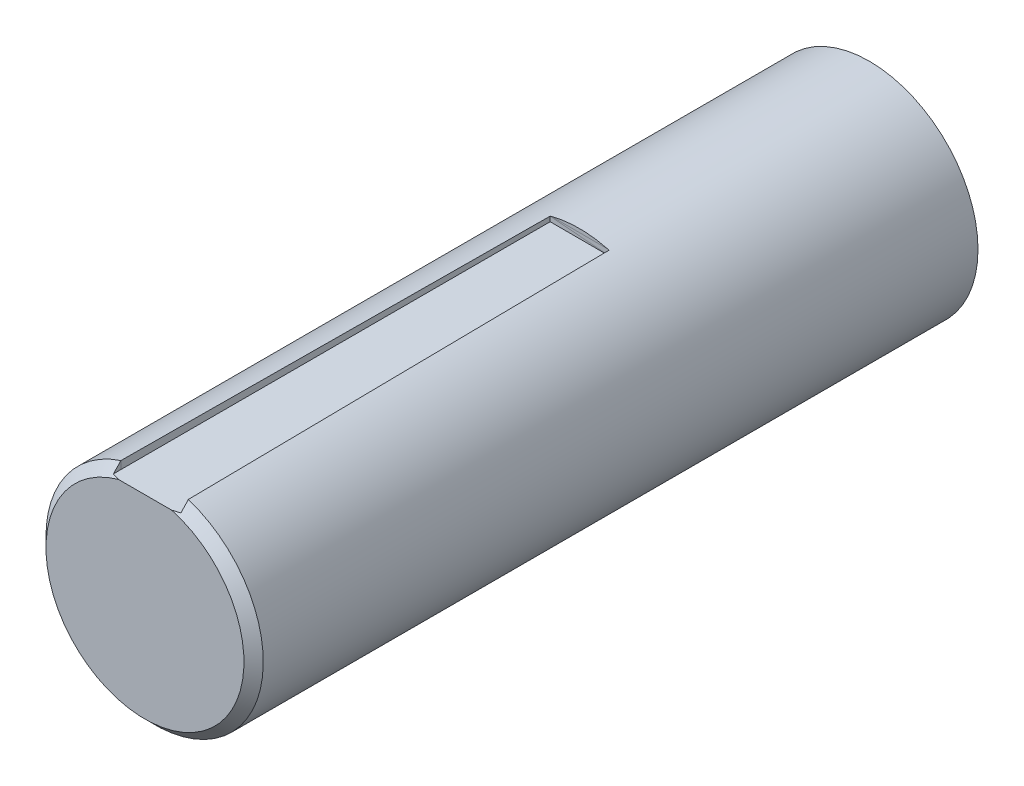
ISO-10303-21;
HEADER;
FILE_DESCRIPTION(('STEP AP214'),'2;1');
FILE_NAME('part.step','',(''),(''),'','','');
FILE_SCHEMA(('AUTOMOTIVE_DESIGN { 1 0 10303 214 1 1 1 1 }'));
ENDSEC;
DATA;
#1=APPLICATION_CONTEXT('core data for automotive mechanical design processes');
#2=APPLICATION_PROTOCOL_DEFINITION('international standard','automotive_design',2000,#1);
#3=PRODUCT_CONTEXT('',#1,'mechanical');
#4=PRODUCT('Part','Part','',(#3));
#5=PRODUCT_RELATED_PRODUCT_CATEGORY('part','',(#4));
#6=PRODUCT_DEFINITION_FORMATION('','',#4);
#7=PRODUCT_DEFINITION_CONTEXT('part definition',#1,'design');
#8=PRODUCT_DEFINITION('design','',#6,#7);
#9=PRODUCT_DEFINITION_SHAPE('','',#8);
#10=(LENGTH_UNIT() NAMED_UNIT(*) SI_UNIT(.MILLI.,.METRE.));
#11=(NAMED_UNIT(*) PLANE_ANGLE_UNIT() SI_UNIT($,.RADIAN.));
#12=(NAMED_UNIT(*) SI_UNIT($,.STERADIAN.) SOLID_ANGLE_UNIT());
#13=UNCERTAINTY_MEASURE_WITH_UNIT(LENGTH_MEASURE(1.E-05),#10,'distance_accuracy_value','');
#14=(GEOMETRIC_REPRESENTATION_CONTEXT(3) GLOBAL_UNCERTAINTY_ASSIGNED_CONTEXT((#13)) GLOBAL_UNIT_ASSIGNED_CONTEXT((#10,
#11,#12)) REPRESENTATION_CONTEXT('',''));
#15=CARTESIAN_POINT('',(0.,0.,0.));
#16=DIRECTION('',(0.,0.,1.));
#17=DIRECTION('',(1.,0.,0.));
#18=AXIS2_PLACEMENT_3D('',#15,#16,#17);
#19=CARTESIAN_POINT('',(0.,0.,150.));
#20=DIRECTION('',(0.,0.,-1.));
#21=DIRECTION('',(-1.,0.,0.));
#22=AXIS2_PLACEMENT_3D('',#19,#20,#21);
#23=CYLINDRICAL_SURFACE('',#22,22.5);
#24=CARTESIAN_POINT('',(0.,0.,0.));
#25=DIRECTION('',(0.,0.,1.));
#26=DIRECTION('',(1.,0.,0.));
#27=AXIS2_PLACEMENT_3D('',#24,#25,#26);
#28=CIRCLE('',#27,22.5);
#29=CARTESIAN_POINT('',(22.5,0.,0.));
#30=VERTEX_POINT('',#29);
#31=EDGE_CURVE('E212',#30,#30,#28,.T.);
#32=ORIENTED_EDGE('',*,*,#31,.T.);
#33=EDGE_LOOP('',(#32));
#34=FACE_BOUND('',#33,.T.);
#35=CARTESIAN_POINT('',(0.,0.,59.7895778569438));
#36=DIRECTION('',(-0.000823485655129395,-0.00994820926528993,0.999950176260692));
#37=DIRECTION('',(-0.0824910158989033,-0.996541814125106,-0.00998223402902398));
#38=AXIS2_PLACEMENT_3D('',#35,#36,#37);
#39=ELLIPSE('',#38,22.5011210899913,22.5);
#40=CARTESIAN_POINT('',(5.78817413864547,21.7427468398249,60.0106567458581));
#41=VERTEX_POINT('',#40);
#42=CARTESIAN_POINT('',(-5.78853045082907,21.7426519822175,60.0011220769788));
#43=VERTEX_POINT('',#42);
#44=EDGE_CURVE('E58',#41,#43,#39,.T.);
#45=ORIENTED_EDGE('',*,*,#44,.F.);
#46=CARTESIAN_POINT('',(0.,0.,-2125.47448485976));
#47=DIRECTION('',(0.,0.999950515308283,-0.00994821263837438));
#48=DIRECTION('',(0.,-0.00994821263837438,-0.999950515308284));
#49=AXIS2_PLACEMENT_3D('',#46,#47,#48);
#50=ELLIPSE('',#49,2261.71281393888,22.5);
#51=CARTESIAN_POINT('',(5.7885723814903,21.7426408190047,60.));
#52=VERTEX_POINT('',#51);
#53=EDGE_CURVE('E52',#52,#41,#50,.F.);
#54=ORIENTED_EDGE('',*,*,#53,.F.);
#55=CARTESIAN_POINT('',(0.,0.,60.));
#56=DIRECTION('',(0.,0.,1.));
#57=DIRECTION('',(1.,0.,0.));
#58=AXIS2_PLACEMENT_3D('',#55,#56,#57);
#59=CIRCLE('',#58,22.5);
#60=CARTESIAN_POINT('',(6.10461655477255,21.6560304931259,60.));
#61=VERTEX_POINT('',#60);
#62=EDGE_CURVE('E11',#61,#52,#59,.T.);
#63=ORIENTED_EDGE('',*,*,#62,.F.);
#64=CARTESIAN_POINT('',(0.,0.,-553.609166953008));
#65=DIRECTION('',(0.999950515308283,0.,-0.00994821263837438));
#66=DIRECTION('',(-0.00994821263837438,0.,-0.999950515308284));
#67=AXIS2_PLACEMENT_3D('',#64,#65,#66);
#68=ELLIPSE('',#67,2261.71281393888,22.5);
#69=CARTESIAN_POINT('',(6.98010259010606,21.3899080837535,148.));
#70=VERTEX_POINT('',#69);
#71=EDGE_CURVE('E290',#70,#61,#68,.F.);
#72=ORIENTED_EDGE('',*,*,#71,.F.);
#73=CARTESIAN_POINT('',(0.,0.,148.));
#74=DIRECTION('',(0.,0.,1.));
#75=DIRECTION('',(1.,0.,0.));
#76=AXIS2_PLACEMENT_3D('',#73,#74,#75);
#77=CIRCLE('',#76,22.5);
#78=CARTESIAN_POINT('',(-6.98010259010981,21.3899081595712,148.000000000754));
#79=VERTEX_POINT('',#78);
#80=EDGE_CURVE('E202',#70,#79,#77,.F.);
#81=ORIENTED_EDGE('',*,*,#80,.T.);
#82=CARTESIAN_POINT('',(-6.10461655477255,21.6560304931061,59.9999999999998));
#83=DIRECTION('',(-0.00994816715353646,-0.00302395481440146,0.999945943372723));
#84=VECTOR('',#83,1.);
#85=LINE('',#82,#84);
#86=CARTESIAN_POINT('',(-6.10461655477255,21.656030493106,59.9999999999998));
#87=VERTEX_POINT('',#86);
#88=EDGE_CURVE('E157',#87,#79,#85,.T.);
#89=ORIENTED_EDGE('',*,*,#88,.F.);
#90=CARTESIAN_POINT('',(-5.7885723814903,21.7426408190047,60.));
#91=VERTEX_POINT('',#90);
#92=EDGE_CURVE('E46',#91,#87,#59,.T.);
#93=ORIENTED_EDGE('',*,*,#92,.F.);
#94=EDGE_CURVE('E267',#43,#91,#50,.F.);
#95=ORIENTED_EDGE('',*,*,#94,.F.);
#96=EDGE_LOOP('',(#45,#54,#63,#72,#81,#89,#93,#95));
#97=FACE_BOUND('',#96,.T.);
#98=ADVANCED_FACE('F40',(#34,#97),#23,.T.);
#99=CARTESIAN_POINT('',(0.,22.6380242642321,150.));
#100=DIRECTION('',(0.,0.999950515308283,-0.00994821263837438));
#101=DIRECTION('',(0.,0.00994821263837438,0.999950515308283));
#102=AXIS2_PLACEMENT_3D('',#99,#100,#101);
#103=PLANE('',#102);
#104=ORIENTED_EDGE('',*,*,#53,.T.);
#105=DIRECTION('',(0.999999660801366,8.19383223769833E-06,0.000823607924988518));
#106=VECTOR('',#105,1.);
#107=CARTESIAN_POINT('',(0.0741271735599891,21.7427000198668,60.0059506098976));
#108=LINE('',#107,#106);
#109=EDGE_CURVE('E275',#41,#43,#108,.F.);
#110=ORIENTED_EDGE('',*,*,#109,.T.);
#111=ORIENTED_EDGE('',*,*,#94,.T.);
#112=DIRECTION('',(-1.,0.,0.));
#113=VECTOR('',#112,1.);
#114=CARTESIAN_POINT('',(0.,21.7426408190047,60.));
#115=LINE('',#114,#113);
#116=EDGE_CURVE('E273',#91,#52,#115,.F.);
#117=ORIENTED_EDGE('',*,*,#116,.T.);
#118=EDGE_LOOP('',(#104,#110,#111,#117));
#119=FACE_BOUND('',#118,.T.);
#120=ADVANCED_FACE('F183',(#119),#103,.F.);
#121=CARTESIAN_POINT('',(0.,0.,60.));
#122=DIRECTION('',(0.,0.,1.));
#123=DIRECTION('',(1.,0.,0.));
#124=AXIS2_PLACEMENT_3D('',#121,#122,#123);
#125=PLANE('',#124);
#126=ORIENTED_EDGE('',*,*,#92,.T.);
#127=DIRECTION('',(0.996591468038605,-0.082495126114561,0.));
#128=VECTOR('',#127,1.);
#129=CARTESIAN_POINT('',(1.73888292919794,21.0067669785738,60.));
#130=LINE('',#129,#128);
#131=CARTESIAN_POINT('',(6.10461655477255,20.6453834452275,60.));
#132=VERTEX_POINT('',#131);
#133=EDGE_CURVE('E121',#87,#132,#130,.T.);
#134=ORIENTED_EDGE('',*,*,#133,.T.);
#135=DIRECTION('',(0.,1.,0.));
#136=VECTOR('',#135,1.);
#137=CARTESIAN_POINT('',(6.10461655477255,0.,60.));
#138=LINE('',#137,#136);
#139=EDGE_CURVE('E277',#61,#132,#138,.F.);
#140=ORIENTED_EDGE('',*,*,#139,.F.);
#141=ORIENTED_EDGE('',*,*,#62,.T.);
#142=ORIENTED_EDGE('',*,*,#116,.F.);
#143=EDGE_LOOP('',(#126,#134,#140,#141,#142));
#144=FACE_BOUND('',#143,.T.);
#145=ADVANCED_FACE('F179',(#144),#125,.T.);
#146=CARTESIAN_POINT('',(-7.00000000000001,0.,150.));
#147=DIRECTION('',(-0.999950515308283,0.,-0.00994821263837438));
#148=DIRECTION('',(-0.00994821263837438,0.,0.999950515308283));
#149=AXIS2_PLACEMENT_3D('',#146,#147,#148);
#150=PLANE('',#149);
#151=DIRECTION('',(9.89718318038703E-05,-0.999950510410814,-0.0099482125896509));
#152=VECTOR('',#151,1.);
#153=CARTESIAN_POINT('',(-6.97798766587082,0.0220145128380417,147.787417131525));
#154=LINE('',#153,#152);
#155=CARTESIAN_POINT('',(-6.97994226261549,19.7700577373845,147.983884586846));
#156=VERTEX_POINT('',#155);
#157=EDGE_CURVE('E153',#79,#156,#154,.T.);
#158=ORIENTED_EDGE('',*,*,#157,.F.);
#159=CARTESIAN_POINT('',(-6.98010060036507,21.3901191125431,147.9998));
#160=CARTESIAN_POINT('',(-6.98267340804539,21.117294411706,148.258407295526));
#161=CARTESIAN_POINT('',(-6.98524325486982,20.8441888076931,148.516716978859));
#162=CARTESIAN_POINT('',(-6.99037702702372,20.2974157702261,149.032741142935));
#163=CARTESIAN_POINT('',(-6.99294095235268,20.0237483367247,149.290455623626));
#164=CARTESIAN_POINT('',(-6.99550191682526,19.7498,149.547872492076));
#165=B_SPLINE_CURVE_WITH_KNOTS('',3,(#159,#160,#161,#162,#163,#164),.UNSPECIFIED.,.F.,.F.,(4,2,
4),(0.,1.12776527169477,2.25553063863649),.UNSPECIFIED.);
#166=CARTESIAN_POINT('',(-6.99545759004928,19.7545424099507,149.543416959802));
#167=VERTEX_POINT('',#166);
#168=EDGE_CURVE('E200',#79,#167,#165,.T.);
#169=ORIENTED_EDGE('',*,*,#168,.T.);
#170=DIRECTION('',(-0.00994772040285509,-0.00994772040285509,0.999901037962044));
#171=VECTOR('',#170,1.);
#172=CARTESIAN_POINT('',(-7.00195440353896,19.748045596461,150.196448035134));
#173=LINE('',#172,#171);
#174=EDGE_CURVE('E66',#156,#167,#173,.T.);
#175=ORIENTED_EDGE('',*,*,#174,.F.);
#176=EDGE_LOOP('',(#158,#169,#175));
#177=FACE_BOUND('',#176,.T.);
#178=ADVANCED_FACE('F182',(#177),#150,.F.);
#179=CARTESIAN_POINT('',(7.,0.,150.));
#180=DIRECTION('',(0.999950515308283,0.,-0.00994821263837438));
#181=DIRECTION('',(-0.00994821263837438,0.,-0.999950515308283));
#182=AXIS2_PLACEMENT_3D('',#179,#180,#181);
#183=PLANE('',#182);
#184=CARTESIAN_POINT('',(6.98010060036507,21.3901191125431,147.9998));
#185=CARTESIAN_POINT('',(6.98267340804539,21.117294411706,148.258407295526));
#186=CARTESIAN_POINT('',(6.98524325486982,20.8441888076931,148.516716978859));
#187=CARTESIAN_POINT('',(6.99037702702372,20.2974157702261,149.032741142935));
#188=CARTESIAN_POINT('',(6.99294095235268,20.0237483367247,149.290455623626));
#189=CARTESIAN_POINT('',(6.99550191682525,19.7498,149.547872492076));
#190=B_SPLINE_CURVE_WITH_KNOTS('',3,(#184,#185,#186,#187,#188,#189),.UNSPECIFIED.,.F.,.F.,(4,2,
4),(0.,1.12776527169477,2.25553063863649),.UNSPECIFIED.);
#191=CARTESIAN_POINT('',(6.99545759004928,19.7545424099507,149.543416959802));
#192=VERTEX_POINT('',#191);
#193=EDGE_CURVE('E232',#70,#192,#190,.T.);
#194=ORIENTED_EDGE('',*,*,#193,.F.);
#195=DIRECTION('',(9.89718318041857E-05,0.999950510410814,0.0099482125896509));
#196=VECTOR('',#195,1.);
#197=CARTESIAN_POINT('',(6.97798766587082,0.0220145128380395,147.787417131525));
#198=LINE('',#197,#196);
#199=CARTESIAN_POINT('',(6.97994226261549,19.7700577373845,147.983884586846));
#200=VERTEX_POINT('',#199);
#201=EDGE_CURVE('E284',#70,#200,#198,.F.);
#202=ORIENTED_EDGE('',*,*,#201,.T.);
#203=DIRECTION('',(-0.00994772040285509,0.00994772040285509,-0.999901037962044));
#204=VECTOR('',#203,1.);
#205=CARTESIAN_POINT('',(7.00195440353896,19.748045596461,150.196448035134));
#206=LINE('',#205,#204);
#207=EDGE_CURVE('E294',#200,#192,#206,.F.);
#208=ORIENTED_EDGE('',*,*,#207,.T.);
#209=EDGE_LOOP('',(#194,#202,#208));
#210=FACE_BOUND('',#209,.T.);
#211=ADVANCED_FACE('F188',(#210),#183,.F.);
#212=ORIENTED_EDGE('',*,*,#139,.T.);
#213=DIRECTION('',(-0.00994785664528011,-0.00845978584925541,-0.999914732450497));
#214=VECTOR('',#213,1.);
#215=CARTESIAN_POINT('',(6.99819847111618,21.4052970548212,149.818918251831));
#216=LINE('',#215,#214);
#217=EDGE_CURVE('E124',#132,#70,#216,.F.);
#218=ORIENTED_EDGE('',*,*,#217,.T.);
#219=ORIENTED_EDGE('',*,*,#71,.T.);
#220=EDGE_LOOP('',(#212,#218,#219));
#221=FACE_BOUND('',#220,.T.);
#222=ADVANCED_FACE('F243',(#221),#183,.F.);
#223=CARTESIAN_POINT('',(0.,0.,150.));
#224=DIRECTION('',(0.,0.,-1.));
#225=DIRECTION('',(-1.,0.,0.));
#226=AXIS2_PLACEMENT_3D('',#223,#224,#225);
#227=CONICAL_SURFACE('',#226,20.5,0.785398163397458);
#228=ORIENTED_EDGE('',*,*,#80,.F.);
#229=ORIENTED_EDGE('',*,*,#193,.T.);
#230=CARTESIAN_POINT('',(5.49357612441709,19.749998010259,150.0002));
#231=CARTESIAN_POINT('',(5.62029077119369,19.7503391081035,149.965914347116));
#232=CARTESIAN_POINT('',(5.74672713135603,19.7506903987369,149.930604159978));
#233=CARTESIAN_POINT('',(5.99900049316049,19.7514126089629,149.858010769195));
#234=CARTESIAN_POINT('',(6.12483762716229,19.7517835239785,149.820728025608));
#235=CARTESIAN_POINT('',(6.37592752083061,19.7525443820797,149.744249920643));
#236=CARTESIAN_POINT('',(6.50118028557036,19.7529343249998,149.705054575902));
#237=CARTESIAN_POINT('',(6.7511224296301,19.7537326638675,149.624809069381));
#238=CARTESIAN_POINT('',(6.87581167133882,19.75414106408,149.583758478907));
#239=CARTESIAN_POINT('',(7.00020000000001,19.7545583131252,149.54181844275));
#240=B_SPLINE_CURVE_WITH_KNOTS('',3,(#230,#231,#232,#233,#234,#235,#236,#237,#238,#239),
.UNSPECIFIED.,.F.,.F.,(4,2,2,2,4),(0.,0.393808954590328,0.787526462605249,1.18124054615596,
1.57504607542073),.UNSPECIFIED.);
#241=CARTESIAN_POINT('',(5.49431524395903,19.75,150.));
#242=VERTEX_POINT('',#241);
#243=EDGE_CURVE('E225',#242,#192,#240,.T.);
#244=ORIENTED_EDGE('',*,*,#243,.F.);
#245=CARTESIAN_POINT('',(0.,0.,150.));
#246=DIRECTION('',(0.,0.,1.));
#247=DIRECTION('',(1.,0.,0.));
#248=AXIS2_PLACEMENT_3D('',#245,#246,#247);
#249=CIRCLE('',#248,20.5);
#250=CARTESIAN_POINT('',(-5.49431524395903,19.75,150.));
#251=VERTEX_POINT('',#250);
#252=EDGE_CURVE('E205',#251,#242,#249,.T.);
#253=ORIENTED_EDGE('',*,*,#252,.F.);
#254=CARTESIAN_POINT('',(-7.0002,19.7545583131252,149.54181844275));
#255=CARTESIAN_POINT('',(-6.87581167133881,19.75414106408,149.583758478907));
#256=CARTESIAN_POINT('',(-6.75112242963009,19.7537326638675,149.624809069381));
#257=CARTESIAN_POINT('',(-6.50118028557035,19.7529343249998,149.705054575902));
#258=CARTESIAN_POINT('',(-6.3759275208306,19.7525443820797,149.744249920643));
#259=CARTESIAN_POINT('',(-6.12483762716229,19.7517835239785,149.820728025608));
#260=CARTESIAN_POINT('',(-5.99900049316049,19.7514126089629,149.858010769195));
#261=CARTESIAN_POINT('',(-5.74672713135603,19.7506903987369,149.930604159978));
#262=CARTESIAN_POINT('',(-5.62029077119369,19.7503391081035,149.965914347116));
#263=CARTESIAN_POINT('',(-5.49357612441709,19.749998010259,150.0002));
#264=B_SPLINE_CURVE_WITH_KNOTS('',3,(#254,#255,#256,#257,#258,#259,#260,#261,#262,#263),
.UNSPECIFIED.,.F.,.F.,(4,2,2,2,4),(0.,0.393805529264767,0.787519612815481,1.18123712083038,
1.57504607542072),.UNSPECIFIED.);
#265=EDGE_CURVE('E204',#167,#251,#264,.T.);
#266=ORIENTED_EDGE('',*,*,#265,.F.);
#267=ORIENTED_EDGE('',*,*,#168,.F.);
#268=EDGE_LOOP('',(#228,#229,#244,#253,#266,#267));
#269=FACE_BOUND('',#268,.T.);
#270=ADVANCED_FACE('F43',(#269),#227,.T.);
#271=CARTESIAN_POINT('',(0.,0.,150.));
#272=DIRECTION('',(0.,0.,1.));
#273=DIRECTION('',(1.,0.,0.));
#274=AXIS2_PLACEMENT_3D('',#271,#272,#273);
#275=PLANE('',#274);
#276=DIRECTION('',(1.,0.,0.));
#277=VECTOR('',#276,1.);
#278=CARTESIAN_POINT('',(0.,19.75,150.));
#279=LINE('',#278,#277);
#280=EDGE_CURVE('E162',#251,#242,#279,.T.);
#281=ORIENTED_EDGE('',*,*,#280,.F.);
#282=ORIENTED_EDGE('',*,*,#252,.T.);
#283=EDGE_LOOP('',(#281,#282));
#284=FACE_BOUND('',#283,.T.);
#285=ADVANCED_FACE('F248',(#284),#275,.T.);
#286=CARTESIAN_POINT('',(0.,0.,0.));
#287=DIRECTION('',(0.,0.,1.));
#288=DIRECTION('',(1.,0.,0.));
#289=AXIS2_PLACEMENT_3D('',#286,#287,#288);
#290=PLANE('',#289);
#291=ORIENTED_EDGE('',*,*,#31,.F.);
#292=EDGE_LOOP('',(#291));
#293=FACE_BOUND('',#292,.T.);
#294=ADVANCED_FACE('F251',(#293),#290,.F.);
#295=CARTESIAN_POINT('',(0.,19.75,150.));
#296=DIRECTION('',(0.,-0.999950515308283,-0.00994821263837438));
#297=DIRECTION('',(0.,0.00994821263837438,-0.999950515308283));
#298=AXIS2_PLACEMENT_3D('',#295,#296,#297);
#299=PLANE('',#298);
#300=DIRECTION('',(-0.00994954227917538,0.00994772022253307,-0.999901019836868));
#301=VECTOR('',#300,1.);
#302=CARTESIAN_POINT('',(6.98010259010606,19.7700577373845,147.983884586846));
#303=LINE('',#302,#301);
#304=CARTESIAN_POINT('',(6.98010259010606,19.7700577373845,147.983884586846));
#305=VERTEX_POINT('',#304);
#306=EDGE_CURVE('E136',#305,#132,#303,.T.);
#307=ORIENTED_EDGE('',*,*,#306,.T.);
#308=DIRECTION('',(-0.999999660935631,8.19221040181045E-06,-0.000823444905195619));
#309=VECTOR('',#308,1.);
#310=CARTESIAN_POINT('',(6.10461655477255,20.6453834452275,60.));
#311=LINE('',#310,#309);
#312=CARTESIAN_POINT('',(-6.10461655477255,20.6454834658679,59.9899463657908));
#313=VERTEX_POINT('',#312);
#314=EDGE_CURVE('E118',#132,#313,#311,.T.);
#315=ORIENTED_EDGE('',*,*,#314,.T.);
#316=DIRECTION('',(-0.00994840561953582,-0.00994772033503896,0.999901031145466));
#317=VECTOR('',#316,1.);
#318=CARTESIAN_POINT('',(-6.10461655477255,20.6454834658679,59.9899463657908));
#319=LINE('',#318,#317);
#320=CARTESIAN_POINT('',(-6.98010259010606,19.7700577373845,147.983884586846));
#321=VERTEX_POINT('',#320);
#322=EDGE_CURVE('E128',#313,#321,#319,.T.);
#323=ORIENTED_EDGE('',*,*,#322,.T.);
#324=DIRECTION('',(1.,0.,0.));
#325=VECTOR('',#324,1.);
#326=CARTESIAN_POINT('',(-6.98010259010606,19.7700577373845,147.983884586846));
#327=LINE('',#326,#325);
#328=EDGE_CURVE('E140',#321,#156,#327,.T.);
#329=ORIENTED_EDGE('',*,*,#328,.T.);
#330=ORIENTED_EDGE('',*,*,#174,.T.);
#331=ORIENTED_EDGE('',*,*,#265,.T.);
#332=ORIENTED_EDGE('',*,*,#280,.T.);
#333=ORIENTED_EDGE('',*,*,#243,.T.);
#334=ORIENTED_EDGE('',*,*,#207,.F.);
#335=EDGE_CURVE('E132',#200,#305,#327,.T.);
#336=ORIENTED_EDGE('',*,*,#335,.T.);
#337=EDGE_LOOP('',(#307,#315,#323,#329,#330,#331,#332,#333,#334,#336));
#338=FACE_BOUND('',#337,.T.);
#339=ADVANCED_FACE('F134',(#338),#299,.F.);
#340=CARTESIAN_POINT('',(6.98010259010606,40.7690185588585,148.192797052252));
#341=DIRECTION('',(-0.999950502079195,-9.89801622477328E-05,0.00994904992914298));
#342=DIRECTION('',(0.00994904997787876,0.,0.999950506977489));
#343=AXIS2_PLACEMENT_3D('',#340,#341,#342);
#344=PLANE('',#343);
#345=ORIENTED_EDGE('',*,*,#306,.F.);
#346=DIRECTION('',(0.,-0.999950515308284,-0.00994821263837438));
#347=VECTOR('',#346,1.);
#348=CARTESIAN_POINT('',(6.98010259010606,40.7690185588585,148.192797052252));
#349=LINE('',#348,#347);
#350=EDGE_CURVE('E143',#70,#305,#349,.T.);
#351=ORIENTED_EDGE('',*,*,#350,.F.);
#352=ORIENTED_EDGE('',*,*,#217,.F.);
#353=EDGE_LOOP('',(#345,#351,#352));
#354=FACE_BOUND('',#353,.T.);
#355=ADVANCED_FACE('F305',(#354),#344,.T.);
#356=CARTESIAN_POINT('',(-6.98010259010606,40.7690185588585,148.192797052252));
#357=DIRECTION('',(0.,0.00994821263837438,-0.999950515308284));
#358=DIRECTION('',(0.,0.999950515308284,0.00994821263837438));
#359=AXIS2_PLACEMENT_3D('',#356,#357,#358);
#360=PLANE('',#359);
#361=ORIENTED_EDGE('',*,*,#350,.T.);
#362=ORIENTED_EDGE('',*,*,#335,.F.);
#363=ORIENTED_EDGE('',*,*,#201,.F.);
#364=EDGE_LOOP('',(#361,#362,#363));
#365=FACE_BOUND('',#364,.T.);
#366=ADVANCED_FACE('F174',(#365),#360,.T.);
#367=ORIENTED_EDGE('',*,*,#157,.T.);
#368=ORIENTED_EDGE('',*,*,#328,.F.);
#369=DIRECTION('',(0.,-0.999950515308284,-0.00994821263837438));
#370=VECTOR('',#369,1.);
#371=CARTESIAN_POINT('',(-6.98010259010606,40.7690185588585,148.192797052252));
#372=LINE('',#371,#370);
#373=EDGE_CURVE('E125',#79,#321,#372,.T.);
#374=ORIENTED_EDGE('',*,*,#373,.F.);
#375=EDGE_LOOP('',(#367,#368,#374));
#376=FACE_BOUND('',#375,.T.);
#377=ADVANCED_FACE('F178',(#376),#360,.T.);
#378=CARTESIAN_POINT('',(6.10461655477255,41.6443442667014,60.2089124654059));
#379=DIRECTION('',(-0.000823485655129395,-0.00994820926528993,0.999950176260692));
#380=DIRECTION('',(0.,-0.999950515308283,-0.00994821263837438));
#381=AXIS2_PLACEMENT_3D('',#378,#379,#380);
#382=PLANE('',#381);
#383=DIRECTION('',(0.,-0.999950515308284,-0.00994821263837438));
#384=VECTOR('',#383,1.);
#385=CARTESIAN_POINT('',(-6.10461655477255,41.6444442873418,60.1988588311966));
#386=LINE('',#385,#384);
#387=EDGE_CURVE('E114',#87,#313,#386,.T.);
#388=ORIENTED_EDGE('',*,*,#387,.T.);
#389=ORIENTED_EDGE('',*,*,#314,.F.);
#390=ORIENTED_EDGE('',*,*,#133,.F.);
#391=EDGE_LOOP('',(#388,#389,#390));
#392=FACE_BOUND('',#391,.T.);
#393=ADVANCED_FACE('F116',(#392),#382,.T.);
#394=CARTESIAN_POINT('',(-6.10461655477255,41.6444442873418,60.1988588311966));
#395=DIRECTION('',(0.999950513388352,-9.89688545159409E-05,0.00994791332575066));
#396=DIRECTION('',(0.00994791337446974,0.,-0.999950518285527));
#397=AXIS2_PLACEMENT_3D('',#394,#395,#396);
#398=PLANE('',#397);
#399=ORIENTED_EDGE('',*,*,#88,.T.);
#400=ORIENTED_EDGE('',*,*,#373,.T.);
#401=ORIENTED_EDGE('',*,*,#322,.F.);
#402=ORIENTED_EDGE('',*,*,#387,.F.);
#403=EDGE_LOOP('',(#399,#400,#401,#402));
#404=FACE_BOUND('',#403,.T.);
#405=ADVANCED_FACE('F129',(#404),#398,.T.);
#406=ORIENTED_EDGE('',*,*,#44,.T.);
#407=ORIENTED_EDGE('',*,*,#109,.F.);
#408=EDGE_LOOP('',(#406,#407));
#409=FACE_BOUND('',#408,.T.);
#410=ADVANCED_FACE('F173',(#409),#382,.T.);
#411=CLOSED_SHELL('',(#98,#120,#145,#178,#211,#222,#270,#285,#294,#339,#355,#366,#377,#393,#405,#410));
#412=MANIFOLD_SOLID_BREP('B2',#411);
#413=ADVANCED_BREP_SHAPE_REPRESENTATION('',(#18,#412),#14);
#414=SHAPE_DEFINITION_REPRESENTATION(#9,#413);
ENDSEC;
END-ISO-10303-21;
